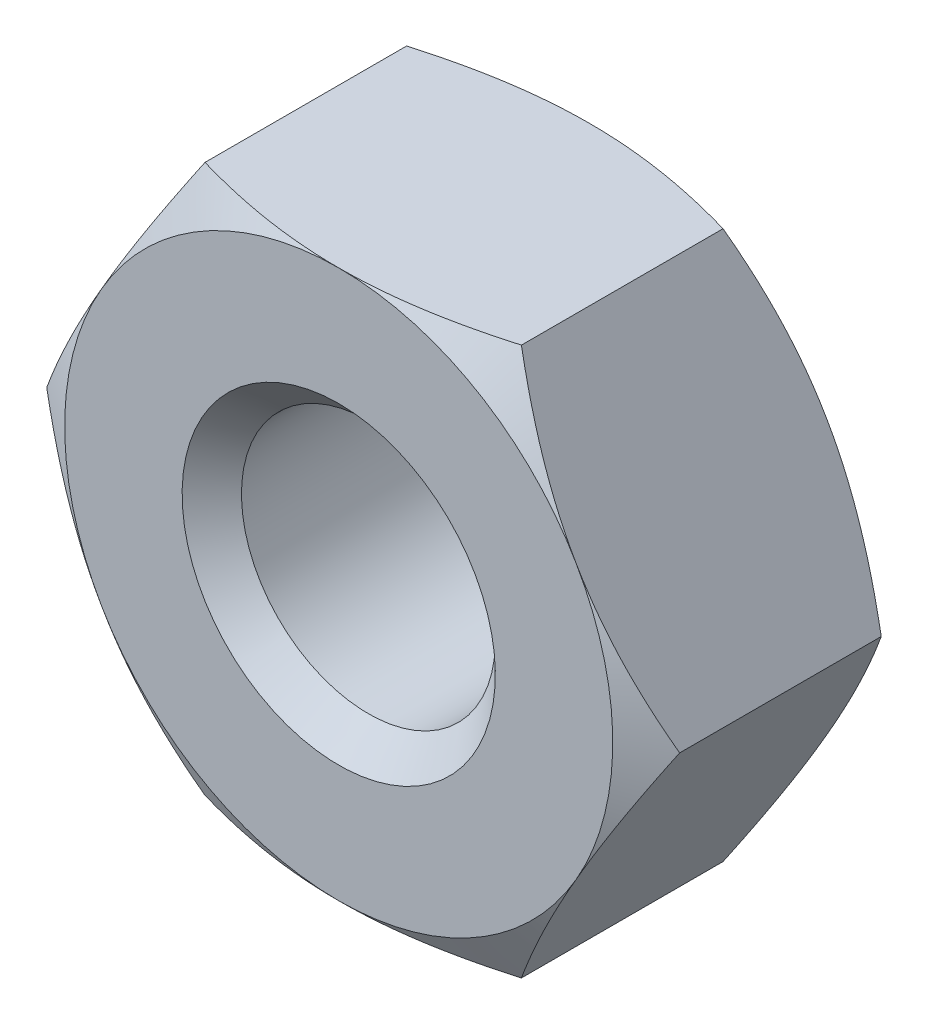
ISO-10303-21;
HEADER;
FILE_DESCRIPTION(('STEP AP214'),'2;1');
FILE_NAME('part.step','',(''),(''),'','','');
FILE_SCHEMA(('AUTOMOTIVE_DESIGN { 1 0 10303 214 1 1 1 1 }'));
ENDSEC;
DATA;
#1=APPLICATION_CONTEXT('core data for automotive mechanical design processes');
#2=APPLICATION_PROTOCOL_DEFINITION('international standard','automotive_design',2000,#1);
#3=PRODUCT_CONTEXT('',#1,'mechanical');
#4=PRODUCT('Part','Part','',(#3));
#5=PRODUCT_RELATED_PRODUCT_CATEGORY('part','',(#4));
#6=PRODUCT_DEFINITION_FORMATION('','',#4);
#7=PRODUCT_DEFINITION_CONTEXT('part definition',#1,'design');
#8=PRODUCT_DEFINITION('design','',#6,#7);
#9=PRODUCT_DEFINITION_SHAPE('','',#8);
#10=(LENGTH_UNIT() NAMED_UNIT(*) SI_UNIT(.MILLI.,.METRE.));
#11=(NAMED_UNIT(*) PLANE_ANGLE_UNIT() SI_UNIT($,.RADIAN.));
#12=(NAMED_UNIT(*) SI_UNIT($,.STERADIAN.) SOLID_ANGLE_UNIT());
#13=UNCERTAINTY_MEASURE_WITH_UNIT(LENGTH_MEASURE(1.E-05),#10,'distance_accuracy_value','');
#14=(GEOMETRIC_REPRESENTATION_CONTEXT(3) GLOBAL_UNCERTAINTY_ASSIGNED_CONTEXT((#13)) GLOBAL_UNIT_ASSIGNED_CONTEXT((#10,
#11,#12)) REPRESENTATION_CONTEXT('',''));
#15=CARTESIAN_POINT('',(0.,0.,0.));
#16=DIRECTION('',(0.,0.,1.));
#17=DIRECTION('',(1.,0.,0.));
#18=AXIS2_PLACEMENT_3D('',#15,#16,#17);
#19=CARTESIAN_POINT('',(0.,0.,0.));
#20=DIRECTION('',(0.,0.,1.));
#21=DIRECTION('',(0.,-1.,0.));
#22=AXIS2_PLACEMENT_3D('',#19,#20,#21);
#23=CONICAL_SURFACE('',#22,3.5,1.0471975511966);
#24=CARTESIAN_POINT('',(-4.04145303902792,-1.99999999942575E-06,0.312608057836595));
#25=CARTESIAN_POINT('',(-3.9526543523417,0.153801836985914,0.261325207051108));
#26=CARTESIAN_POINT('',(-3.8630891566982,0.308933306430309,0.214686129843125));
#27=CARTESIAN_POINT('',(-3.68240800237188,0.621882245693687,0.133279002154489));
#28=CARTESIAN_POINT('',(-3.59128883436789,0.779705274219995,0.0985397473195982));
#29=CARTESIAN_POINT('',(-3.41017969311695,1.0933955085818,0.04446556637395));
#30=CARTESIAN_POINT('',(-3.32021757810618,1.2492144625368,0.0247707051024597));
#31=CARTESIAN_POINT('',(-3.13987026516455,1.56158517156023,0.00126350234264278));
#32=CARTESIAN_POINT('',(-3.049485722302,1.71813579201706,-0.00256830976409229));
#33=CARTESIAN_POINT('',(-2.88061174798552,2.01063409560929,0.00542331795289644));
#34=CARTESIAN_POINT('',(-2.8020969762473,2.14662566940455,0.0152845482259451));
#35=CARTESIAN_POINT('',(-2.64557893115677,2.41772287580271,0.0465326054195978));
#36=CARTESIAN_POINT('',(-2.5675761987588,2.55282757144519,0.0679300962771088));
#37=CARTESIAN_POINT('',(-2.41073570896219,2.82448326845691,0.121419707592684));
#38=CARTESIAN_POINT('',(-2.33191779193778,2.96099990528993,0.153738462339012));
#39=CARTESIAN_POINT('',(-2.1754571904442,3.2319976164596,0.227088382233704));
#40=CARTESIAN_POINT('',(-2.09781250306361,3.36648215994059,0.268102324014377));
#41=CARTESIAN_POINT('',(-2.02072478746315,3.500002,0.312608057836596));
#42=B_SPLINE_CURVE_WITH_KNOTS('',3,(#24,#25,#26,#27,#28,#29,#30,#31,#32,#33,#34,#35,#36,#37,#38,
#39,#40,#41),.UNSPECIFIED.,.F.,.F.,(4,2,2,2,2,2,2,2,4),(0.,0.554778178344818,1.1108895003682,
1.65323877434932,2.19492216043833,2.66649024647641,3.13849499186579,3.62096657220665,
4.10249125897129),.UNSPECIFIED.);
#43=CARTESIAN_POINT('',(-3.03108891324554,1.75,0.));
#44=VERTEX_POINT('',#43);
#45=CARTESIAN_POINT('',(-2.02072594216369,3.5,0.312607391169643));
#46=VERTEX_POINT('',#45);
#47=EDGE_CURVE('E222',#44,#46,#42,.T.);
#48=ORIENTED_EDGE('',*,*,#47,.T.);
#49=CARTESIAN_POINT('',(-5.35934692412504,3.5,1.6748840414578));
#50=CARTESIAN_POINT('',(-5.20567647840356,3.5,1.60062164540258));
#51=CARTESIAN_POINT('',(-5.05164271451145,3.5,1.52709745330194));
#52=CARTESIAN_POINT('',(-4.74265210486078,3.5,1.38194731027651));
#53=CARTESIAN_POINT('',(-4.58769510490404,3.5,1.31032168799129));
#54=CARTESIAN_POINT('',(-4.275824553831,3.5,1.16901320847468));
#55=CARTESIAN_POINT('',(-4.11890488076336,3.5,1.09934381371584));
#56=CARTESIAN_POINT('',(-3.80377582374881,3.5,0.962997372539523));
#57=CARTESIAN_POINT('',(-3.64556650753467,3.5,0.896320170151796));
#58=CARTESIAN_POINT('',(-3.32564210305103,3.5,0.765962027723632));
#59=CARTESIAN_POINT('',(-3.16390782137574,3.5,0.702327933712004));
#60=CARTESIAN_POINT('',(-2.838531618061,3.5,0.580043345264359));
#61=CARTESIAN_POINT('',(-2.6748894864838,3.5,0.521393405279084));
#62=CARTESIAN_POINT('',(-2.34577331272591,3.5,0.410652971362006));
#63=CARTESIAN_POINT('',(-2.18030401104538,3.5,0.358548532806305));
#64=CARTESIAN_POINT('',(-1.84701304087969,3.5,0.262591230795525));
#65=CARTESIAN_POINT('',(-1.67919213437666,3.5,0.218735757984312));
#66=CARTESIAN_POINT('',(-1.34108336693728,3.5,0.141405407149236));
#67=CARTESIAN_POINT('',(-1.17079486277189,3.5,0.107933288625102));
#68=CARTESIAN_POINT('',(-0.828164666046136,3.5,0.0536232411847831));
#69=CARTESIAN_POINT('',(-0.655822971685647,3.5,0.0327853233463299));
#70=CARTESIAN_POINT('',(-0.311079729709311,3.5,0.00558710240427237));
#71=CARTESIAN_POINT('',(-0.138685602003801,3.5,-0.000864864155453443));
#72=CARTESIAN_POINT('',(0.205982076333879,3.5,0.00105162467073649));
#73=CARTESIAN_POINT('',(0.378255646651036,3.5,0.00941623254121618));
#74=CARTESIAN_POINT('',(0.672435089180329,3.5,0.0357628772519745));
#75=CARTESIAN_POINT('',(0.794665505380771,3.5,0.0503133304052149));
#76=CARTESIAN_POINT('',(1.03818220100523,3.5,0.085926760416871));
#77=CARTESIAN_POINT('',(1.15946832844467,3.5,0.106990764298889));
#78=CARTESIAN_POINT('',(1.52181137729793,3.5,0.178847624115623));
#79=CARTESIAN_POINT('',(1.76116994121843,3.5,0.23828682891582));
#80=CARTESIAN_POINT('',(2.11933379257993,3.5,0.340804107281189));
#81=CARTESIAN_POINT('',(2.24000598915561,3.5,0.377725589264581));
#82=CARTESIAN_POINT('',(2.48009089087908,3.5,0.455222131908248));
#83=CARTESIAN_POINT('',(2.59950440212693,3.5,0.495794672641366));
#84=CARTESIAN_POINT('',(2.83657258518354,3.5,0.579749074905746));
#85=CARTESIAN_POINT('',(2.95423337362994,3.5,0.623113838589409));
#86=CARTESIAN_POINT('',(3.18864204487703,3.5,0.712388757549099));
#87=CARTESIAN_POINT('',(3.30538953667539,3.5,0.758299941515014));
#88=CARTESIAN_POINT('',(3.42171488807854,3.5,0.805233055846148));
#89=B_SPLINE_CURVE_WITH_KNOTS('',3,(#49,#50,#51,#52,#53,#54,#55,#56,#57,#58,#59,#60,#61,#62,#63,
#64,#65,#66,#67,#68,#69,#70,#71,#72,#73,#74,#75,#76,#77,#78,#79,#80,#81,#82,#83,#84,#85,#86,#87,
#88),.UNSPECIFIED.,.F.,.F.,(4,2,2,2,2,2,2,2,2,2,2,2,2,2,2,2,2,2,2,4),(0.,0.512027950737723,
1.02414396148803,1.53919045875332,2.05421007757958,2.57555381631374,3.09695547502097,
3.61722678349793,4.13733323922925,4.65757780124304,5.1778228194093,5.69474338573791,
6.21152973964697,6.58062976625125,6.94978802037408,7.68865391675854,8.06720645375622,
8.4454996923548,8.82166367886255,9.19798074895271),.UNSPECIFIED.);
#90=CARTESIAN_POINT('',(0.,3.5,0.));
#91=VERTEX_POINT('',#90);
#92=EDGE_CURVE('E119',#46,#91,#89,.T.);
#93=ORIENTED_EDGE('',*,*,#92,.T.);
#94=CARTESIAN_POINT('',(0.,0.,0.));
#95=DIRECTION('',(0.,0.,-1.));
#96=DIRECTION('',(0.,1.,0.));
#97=AXIS2_PLACEMENT_3D('',#94,#95,#96);
#98=CIRCLE('',#97,3.5);
#99=EDGE_CURVE('E254',#44,#91,#98,.T.);
#100=ORIENTED_EDGE('',*,*,#99,.F.);
#101=EDGE_LOOP('',(#48,#93,#100));
#102=FACE_BOUND('',#101,.T.);
#103=ADVANCED_FACE('F16',(#102),#23,.T.);
#104=CARTESIAN_POINT('',(3.03108891324554,1.75,0.));
#105=VERTEX_POINT('',#104);
#106=EDGE_CURVE('E246',#91,#105,#98,.T.);
#107=ORIENTED_EDGE('',*,*,#106,.F.);
#108=CARTESIAN_POINT('',(2.02072594216369,3.5,0.312607391169643));
#109=VERTEX_POINT('',#108);
#110=EDGE_CURVE('E216',#91,#109,#89,.T.);
#111=ORIENTED_EDGE('',*,*,#110,.T.);
#112=CARTESIAN_POINT('',(2.02072478746316,3.500002,0.312608057836596));
#113=CARTESIAN_POINT('',(2.10952347414937,3.34619816301409,0.261325207051108));
#114=CARTESIAN_POINT('',(2.19908866979287,3.19106669356969,0.214686129843125));
#115=CARTESIAN_POINT('',(2.37976982411919,2.87811775430631,0.133279002154489));
#116=CARTESIAN_POINT('',(2.47088899212318,2.72029472578,0.0985397473195982));
#117=CARTESIAN_POINT('',(2.65199813337412,2.4066044914182,0.0444655663739501));
#118=CARTESIAN_POINT('',(2.74196024838489,2.2507855374632,0.0247707051024598));
#119=CARTESIAN_POINT('',(2.92230756132652,1.93841482843977,0.0012635023426431));
#120=CARTESIAN_POINT('',(3.01269210418907,1.78186420798294,-0.00256830976409182));
#121=CARTESIAN_POINT('',(3.18156607850555,1.48936590439071,0.0054233179528968));
#122=CARTESIAN_POINT('',(3.26008085024377,1.35337433059545,0.0152845482259452));
#123=CARTESIAN_POINT('',(3.4165988953343,1.08227712419729,0.0465326054195978));
#124=CARTESIAN_POINT('',(3.49460162773227,0.94717242855481,0.0679300962771087));
#125=CARTESIAN_POINT('',(3.65144211752888,0.675516731543088,0.121419707592684));
#126=CARTESIAN_POINT('',(3.73026003455329,0.539000094710069,0.153738462339012));
#127=CARTESIAN_POINT('',(3.88672063604687,0.268002383540401,0.227088382233704));
#128=CARTESIAN_POINT('',(3.96436532342746,0.133517840059407,0.268102324014377));
#129=CARTESIAN_POINT('',(4.04145303902792,-2.00000000017778E-06,0.312608057836595));
#130=B_SPLINE_CURVE_WITH_KNOTS('',3,(#112,#113,#114,#115,#116,#117,#118,#119,#120,#121,#122,
#123,#124,#125,#126,#127,#128,#129),.UNSPECIFIED.,.F.,.F.,(4,2,2,2,2,2,2,2,4),(0.,
0.554778178344817,1.1108895003682,1.65323877434931,2.19492216043833,2.66649024647641,
3.13849499186579,3.62096657220665,4.10249125897128),.UNSPECIFIED.);
#131=EDGE_CURVE('E210',#109,#105,#130,.T.);
#132=ORIENTED_EDGE('',*,*,#131,.T.);
#133=EDGE_LOOP('',(#107,#111,#132));
#134=FACE_BOUND('',#133,.T.);
#135=ADVANCED_FACE('F243',(#134),#23,.T.);
#136=CARTESIAN_POINT('',(3.03108891324554,-1.75,0.));
#137=VERTEX_POINT('',#136);
#138=EDGE_CURVE('E252',#105,#137,#98,.T.);
#139=ORIENTED_EDGE('',*,*,#138,.F.);
#140=CARTESIAN_POINT('',(4.04145188432738,0.,0.312607391169643));
#141=VERTEX_POINT('',#140);
#142=EDGE_CURVE('E202',#105,#141,#130,.T.);
#143=ORIENTED_EDGE('',*,*,#142,.T.);
#144=CARTESIAN_POINT('',(4.04145303902792,1.99999999977168E-06,0.312608057836595));
#145=CARTESIAN_POINT('',(3.95265435234171,-0.153801836985914,0.261325207051109));
#146=CARTESIAN_POINT('',(3.8630891566982,-0.30893330643031,0.214686129843126));
#147=CARTESIAN_POINT('',(3.68240800237188,-0.621882245693688,0.13327900215449));
#148=CARTESIAN_POINT('',(3.5912888343679,-0.779705274219996,0.0985397473195994));
#149=CARTESIAN_POINT('',(3.41017969311695,-1.0933955085818,0.0444655663739513));
#150=CARTESIAN_POINT('',(3.32021757810618,-1.2492144625368,0.024770705102461));
#151=CARTESIAN_POINT('',(3.13987026516455,-1.56158517156023,0.00126350234264337));
#152=CARTESIAN_POINT('',(3.049485722302,-1.71813579201706,-0.00256830976409247));
#153=CARTESIAN_POINT('',(2.88061174798552,-2.01063409560929,0.00542331795289657));
#154=CARTESIAN_POINT('',(2.8020969762473,-2.14662566940455,0.015284548225946));
#155=CARTESIAN_POINT('',(2.64557893115677,-2.41772287580271,0.0465326054195992));
#156=CARTESIAN_POINT('',(2.5675761987588,-2.55282757144519,0.0679300962771096));
#157=CARTESIAN_POINT('',(2.41073570896219,-2.82448326845691,0.121419707592684));
#158=CARTESIAN_POINT('',(2.33191779193778,-2.96099990528993,0.153738462339012));
#159=CARTESIAN_POINT('',(2.1754571904442,-3.2319976164596,0.227088382233704));
#160=CARTESIAN_POINT('',(2.09781250306361,-3.36648215994059,0.268102324014377));
#161=CARTESIAN_POINT('',(2.02072478746315,-3.500002,0.312608057836596));
#162=B_SPLINE_CURVE_WITH_KNOTS('',3,(#144,#145,#146,#147,#148,#149,#150,#151,#152,#153,#154,
#155,#156,#157,#158,#159,#160,#161),.UNSPECIFIED.,.F.,.F.,(4,2,2,2,2,2,2,2,4),(0.,
0.554778178344817,1.1108895003682,1.65323877434932,2.19492216043833,2.66649024647641,
3.13849499186579,3.62096657220665,4.10249125897129),.UNSPECIFIED.);
#163=EDGE_CURVE('E623',#141,#137,#162,.T.);
#164=ORIENTED_EDGE('',*,*,#163,.T.);
#165=EDGE_LOOP('',(#139,#143,#164));
#166=FACE_BOUND('',#165,.T.);
#167=ADVANCED_FACE('F324',(#166),#23,.T.);
#168=CARTESIAN_POINT('',(-2.02072478746316,-3.500002,0.312608057836596));
#169=CARTESIAN_POINT('',(-2.10952347414937,-3.34619816301409,0.261325207051108));
#170=CARTESIAN_POINT('',(-2.19908866979287,-3.19106669356969,0.214686129843125));
#171=CARTESIAN_POINT('',(-2.37976982411919,-2.87811775430631,0.133279002154489));
#172=CARTESIAN_POINT('',(-2.47088899212318,-2.72029472578,0.0985397473195984));
#173=CARTESIAN_POINT('',(-2.65199813337412,-2.4066044914182,0.0444655663739503));
#174=CARTESIAN_POINT('',(-2.74196024838489,-2.25078553746319,0.0247707051024599));
#175=CARTESIAN_POINT('',(-2.92230756132652,-1.93841482843977,0.00126350234264309));
#176=CARTESIAN_POINT('',(-3.01269210418907,-1.78186420798294,-0.00256830976409179));
#177=CARTESIAN_POINT('',(-3.18156607850555,-1.48936590439071,0.00542331795289685));
#178=CARTESIAN_POINT('',(-3.26008085024377,-1.35337433059545,0.0152845482259453));
#179=CARTESIAN_POINT('',(-3.4165988953343,-1.08227712419729,0.0465326054195978));
#180=CARTESIAN_POINT('',(-3.49460162773227,-0.947172428554809,0.0679300962771088));
#181=CARTESIAN_POINT('',(-3.65144211752888,-0.675516731543088,0.121419707592684));
#182=CARTESIAN_POINT('',(-3.73026003455329,-0.539000094710069,0.153738462339012));
#183=CARTESIAN_POINT('',(-3.88672063604687,-0.2680023835404,0.227088382233704));
#184=CARTESIAN_POINT('',(-3.96436532342746,-0.133517840059406,0.268102324014377));
#185=CARTESIAN_POINT('',(-4.04145303902792,2.00000000086035E-06,0.312608057836595));
#186=B_SPLINE_CURVE_WITH_KNOTS('',3,(#168,#169,#170,#171,#172,#173,#174,#175,#176,#177,#178,
#179,#180,#181,#182,#183,#184,#185),.UNSPECIFIED.,.F.,.F.,(4,2,2,2,2,2,2,2,4),(0.,
0.554778178344817,1.1108895003682,1.65323877434931,2.19492216043833,2.66649024647641,
3.13849499186579,3.62096657220665,4.10249125897128),.UNSPECIFIED.);
#187=CARTESIAN_POINT('',(-3.03108891324554,-1.75,0.));
#188=VERTEX_POINT('',#187);
#189=CARTESIAN_POINT('',(-4.04145188432738,0.,0.312607391169643));
#190=VERTEX_POINT('',#189);
#191=EDGE_CURVE('E626',#188,#190,#186,.T.);
#192=ORIENTED_EDGE('',*,*,#191,.T.);
#193=EDGE_CURVE('E211',#190,#44,#42,.T.);
#194=ORIENTED_EDGE('',*,*,#193,.T.);
#195=EDGE_CURVE('E262',#188,#44,#98,.T.);
#196=ORIENTED_EDGE('',*,*,#195,.F.);
#197=EDGE_LOOP('',(#192,#194,#196));
#198=FACE_BOUND('',#197,.T.);
#199=ADVANCED_FACE('F331',(#198),#23,.T.);
#200=CARTESIAN_POINT('',(0.,-3.5,0.));
#201=VERTEX_POINT('',#200);
#202=EDGE_CURVE('E259',#137,#201,#98,.T.);
#203=ORIENTED_EDGE('',*,*,#202,.F.);
#204=CARTESIAN_POINT('',(2.02072594216369,-3.5,0.312607391169643));
#205=VERTEX_POINT('',#204);
#206=EDGE_CURVE('E38',#137,#205,#162,.T.);
#207=ORIENTED_EDGE('',*,*,#206,.T.);
#208=CARTESIAN_POINT('',(-5.35934692412504,-3.5,1.6748840414578));
#209=CARTESIAN_POINT('',(-5.20567647840356,-3.5,1.60062164540258));
#210=CARTESIAN_POINT('',(-5.05164271451145,-3.5,1.52709745330194));
#211=CARTESIAN_POINT('',(-4.74265210486078,-3.5,1.38194731027651));
#212=CARTESIAN_POINT('',(-4.58769510490404,-3.5,1.31032168799129));
#213=CARTESIAN_POINT('',(-4.275824553831,-3.5,1.16901320847468));
#214=CARTESIAN_POINT('',(-4.11890488076336,-3.5,1.09934381371584));
#215=CARTESIAN_POINT('',(-3.80377582374881,-3.5,0.962997372539522));
#216=CARTESIAN_POINT('',(-3.64556650753466,-3.5,0.896320170151795));
#217=CARTESIAN_POINT('',(-3.32564210305102,-3.5,0.765962027723632));
#218=CARTESIAN_POINT('',(-3.16390782137574,-3.5,0.702327933712004));
#219=CARTESIAN_POINT('',(-2.838531618061,-3.5,0.580043345264358));
#220=CARTESIAN_POINT('',(-2.67488948648379,-3.5,0.521393405279083));
#221=CARTESIAN_POINT('',(-2.34577331272591,-3.5,0.410652971362005));
#222=CARTESIAN_POINT('',(-2.18030401104538,-3.5,0.358548532806305));
#223=CARTESIAN_POINT('',(-1.84701304087969,-3.5,0.262591230795526));
#224=CARTESIAN_POINT('',(-1.67919213437666,-3.5,0.218735757984312));
#225=CARTESIAN_POINT('',(-1.34108336693728,-3.5,0.141405407149236));
#226=CARTESIAN_POINT('',(-1.1707948627719,-3.5,0.107933288625103));
#227=CARTESIAN_POINT('',(-0.828164666046137,-3.5,0.0536232411847841));
#228=CARTESIAN_POINT('',(-0.655822971685649,-3.5,0.032785323346331));
#229=CARTESIAN_POINT('',(-0.311079729709314,-3.5,0.00558710240427367));
#230=CARTESIAN_POINT('',(-0.138685602003805,-3.5,-0.000864864155452));
#231=CARTESIAN_POINT('',(0.205982076333874,-3.5,0.0010516246707375));
#232=CARTESIAN_POINT('',(0.378255646651032,-3.5,0.00941623254121668));
#233=CARTESIAN_POINT('',(0.672435089180325,-3.5,0.0357628772519751));
#234=CARTESIAN_POINT('',(0.794665505380768,-3.5,0.0503133304052159));
#235=CARTESIAN_POINT('',(1.03818220100523,-3.5,0.0859267604168723));
#236=CARTESIAN_POINT('',(1.15946832844466,-3.5,0.10699076429889));
#237=CARTESIAN_POINT('',(1.52181137729793,-3.5,0.178847624115624));
#238=CARTESIAN_POINT('',(1.76116994121843,-3.5,0.238286828915822));
#239=CARTESIAN_POINT('',(2.11933379257993,-3.5,0.340804107281191));
#240=CARTESIAN_POINT('',(2.24000598915561,-3.5,0.377725589264582));
#241=CARTESIAN_POINT('',(2.48009089087908,-3.5,0.45522213190825));
#242=CARTESIAN_POINT('',(2.59950440212693,-3.5,0.495794672641368));
#243=CARTESIAN_POINT('',(2.83657258518354,-3.5,0.579749074905749));
#244=CARTESIAN_POINT('',(2.95423337362994,-3.5,0.623113838589411));
#245=CARTESIAN_POINT('',(3.18864204487703,-3.5,0.712388757549101));
#246=CARTESIAN_POINT('',(3.30538953667539,-3.5,0.758299941515016));
#247=CARTESIAN_POINT('',(3.42171488807854,-3.5,0.80523305584615));
#248=B_SPLINE_CURVE_WITH_KNOTS('',3,(#208,#209,#210,#211,#212,#213,#214,#215,#216,#217,#218,
#219,#220,#221,#222,#223,#224,#225,#226,#227,#228,#229,#230,#231,#232,#233,#234,#235,#236,#237,
#238,#239,#240,#241,#242,#243,#244,#245,#246,#247),.UNSPECIFIED.,.F.,.F.,(4,2,2,2,2,2,2,2,2,2,2,
2,2,2,2,2,2,2,2,4),(0.,0.512027950737723,1.02414396148803,1.53919045875332,2.05421007757958,
2.57555381631375,3.09695547502097,3.61722678349793,4.13733323922925,4.65757780124304,
5.1778228194093,5.6947433857379,6.21152973964697,6.58062976625124,6.94978802037408,
7.68865391675854,8.06720645375622,8.4454996923548,8.82166367886255,9.19798074895271),.UNSPECIFIED.);
#249=EDGE_CURVE('E11',#205,#201,#248,.F.);
#250=ORIENTED_EDGE('',*,*,#249,.T.);
#251=EDGE_LOOP('',(#203,#207,#250));
#252=FACE_BOUND('',#251,.T.);
#253=ADVANCED_FACE('F327',(#252),#23,.T.);
#254=CARTESIAN_POINT('',(-2.02072594216369,-3.5,0.312607391169643));
#255=VERTEX_POINT('',#254);
#256=EDGE_CURVE('E21',#201,#255,#248,.F.);
#257=ORIENTED_EDGE('',*,*,#256,.T.);
#258=EDGE_CURVE('E126',#255,#188,#186,.T.);
#259=ORIENTED_EDGE('',*,*,#258,.T.);
#260=EDGE_CURVE('E269',#201,#188,#98,.T.);
#261=ORIENTED_EDGE('',*,*,#260,.F.);
#262=EDGE_LOOP('',(#257,#259,#261));
#263=FACE_BOUND('',#262,.T.);
#264=ADVANCED_FACE('F152',(#263),#23,.T.);
#265=CARTESIAN_POINT('',(0.,0.,2.88678747896463));
#266=DIRECTION('',(0.,0.,-1.));
#267=DIRECTION('',(0.,1.,0.));
#268=AXIS2_PLACEMENT_3D('',#265,#266,#267);
#269=CONICAL_SURFACE('',#268,4.0425,1.0471975511966);
#270=CARTESIAN_POINT('',(-5.35934692412504,-3.5,1.5251159585422));
#271=CARTESIAN_POINT('',(-5.20567647840356,-3.5,1.59937835459742));
#272=CARTESIAN_POINT('',(-5.05164271451144,-3.5,1.67290254669806));
#273=CARTESIAN_POINT('',(-4.74265210486078,-3.5,1.8180526897235));
#274=CARTESIAN_POINT('',(-4.58769510490403,-3.5,1.88967831200871));
#275=CARTESIAN_POINT('',(-4.275824553831,-3.5,2.03098679152532));
#276=CARTESIAN_POINT('',(-4.11890488076336,-3.5,2.10065618628416));
#277=CARTESIAN_POINT('',(-3.8037758237488,-3.5,2.23700262746048));
#278=CARTESIAN_POINT('',(-3.64556650753466,-3.5,2.30367982984821));
#279=CARTESIAN_POINT('',(-3.32564210305102,-3.5,2.43403797227637));
#280=CARTESIAN_POINT('',(-3.16390782137574,-3.5,2.497672066288));
#281=CARTESIAN_POINT('',(-2.838531618061,-3.5,2.61995665473564));
#282=CARTESIAN_POINT('',(-2.67488948648379,-3.5,2.67860659472092));
#283=CARTESIAN_POINT('',(-2.34577331272591,-3.5,2.789347028638));
#284=CARTESIAN_POINT('',(-2.18030401104538,-3.5,2.8414514671937));
#285=CARTESIAN_POINT('',(-1.84701304087969,-3.5,2.93740876920448));
#286=CARTESIAN_POINT('',(-1.67919213437666,-3.5,2.98126424201569));
#287=CARTESIAN_POINT('',(-1.34108336693728,-3.5,3.05859459285077));
#288=CARTESIAN_POINT('',(-1.17079486277189,-3.5,3.0920667113749));
#289=CARTESIAN_POINT('',(-0.828164666046137,-3.5,3.14637675881522));
#290=CARTESIAN_POINT('',(-0.655822971685649,-3.5,3.16721467665367));
#291=CARTESIAN_POINT('',(-0.311079729709314,-3.5,3.19441289759573));
#292=CARTESIAN_POINT('',(-0.138685602003804,-3.5,3.20086486415545));
#293=CARTESIAN_POINT('',(0.205982076333875,-3.5,3.19894837532926));
#294=CARTESIAN_POINT('',(0.378255646651032,-3.5,3.19058376745879));
#295=CARTESIAN_POINT('',(0.672435089180325,-3.5,3.16423712274803));
#296=CARTESIAN_POINT('',(0.794665505380768,-3.5,3.14968666959479));
#297=CARTESIAN_POINT('',(1.03818220100523,-3.5,3.11407323958313));
#298=CARTESIAN_POINT('',(1.15946832844466,-3.5,3.09300923570111));
#299=CARTESIAN_POINT('',(1.52181137729793,-3.5,3.02115237588438));
#300=CARTESIAN_POINT('',(1.76116994121843,-3.5,2.96171317108418));
#301=CARTESIAN_POINT('',(2.11933379257993,-3.5,2.85919589271881));
#302=CARTESIAN_POINT('',(2.24000598915561,-3.5,2.82227441073542));
#303=CARTESIAN_POINT('',(2.48009089087908,-3.5,2.74477786809175));
#304=CARTESIAN_POINT('',(2.59950440212692,-3.5,2.70420532735863));
#305=CARTESIAN_POINT('',(2.83657258518354,-3.5,2.62025092509426));
#306=CARTESIAN_POINT('',(2.95423337362993,-3.5,2.57688616141059));
#307=CARTESIAN_POINT('',(3.18864204487703,-3.5,2.4876112424509));
#308=CARTESIAN_POINT('',(3.30538953667538,-3.5,2.44170005848499));
#309=CARTESIAN_POINT('',(3.42171488807853,-3.5,2.39476694415385));
#310=B_SPLINE_CURVE_WITH_KNOTS('',3,(#270,#271,#272,#273,#274,#275,#276,#277,#278,#279,#280,
#281,#282,#283,#284,#285,#286,#287,#288,#289,#290,#291,#292,#293,#294,#295,#296,#297,#298,#299,
#300,#301,#302,#303,#304,#305,#306,#307,#308,#309),.UNSPECIFIED.,.F.,.F.,(4,2,2,2,2,2,2,2,2,2,2,
2,2,2,2,2,2,2,2,4),(0.,0.512027950737725,1.02414396148804,1.53919045875332,2.05421007757959,
2.57555381631375,3.09695547502098,3.61722678349793,4.13733323922926,4.65757780124304,
5.1778228194093,5.6947433857379,6.21152973964697,6.58062976625124,6.94978802037408,
7.68865391675854,8.06720645375622,8.44549969235479,8.82166367886254,9.19798074895271),.UNSPECIFIED.);
#311=CARTESIAN_POINT('',(0.,-3.5,3.2));
#312=VERTEX_POINT('',#311);
#313=CARTESIAN_POINT('',(2.02072594216369,-3.5,2.88739260883036));
#314=VERTEX_POINT('',#313);
#315=EDGE_CURVE('E115',#312,#314,#310,.T.);
#316=ORIENTED_EDGE('',*,*,#315,.T.);
#317=CARTESIAN_POINT('',(2.02072478746315,-3.500002,2.88739194216341));
#318=CARTESIAN_POINT('',(2.10952347414936,-3.34619816301409,2.93867479294889));
#319=CARTESIAN_POINT('',(2.19908866979287,-3.19106669356969,2.98531387015688));
#320=CARTESIAN_POINT('',(2.37976982411919,-2.87811775430631,3.06672099784551));
#321=CARTESIAN_POINT('',(2.47088899212317,-2.72029472578001,3.1014602526804));
#322=CARTESIAN_POINT('',(2.65199813337412,-2.40660449141821,3.15553443362605));
#323=CARTESIAN_POINT('',(2.74196024838489,-2.2507855374632,3.17522929489754));
#324=CARTESIAN_POINT('',(2.92230756132652,-1.93841482843977,3.19873649765736));
#325=CARTESIAN_POINT('',(3.01269210418907,-1.78186420798294,3.20256830976409));
#326=CARTESIAN_POINT('',(3.18156607850555,-1.48936590439071,3.19457668204711));
#327=CARTESIAN_POINT('',(3.26008085024377,-1.35337433059545,3.18471545177406));
#328=CARTESIAN_POINT('',(3.4165988953343,-1.08227712419729,3.1534673945804));
#329=CARTESIAN_POINT('',(3.49460162773227,-0.947172428554813,3.13206990372289));
#330=CARTESIAN_POINT('',(3.65144211752888,-0.675516731543091,3.07858029240732));
#331=CARTESIAN_POINT('',(3.73026003455329,-0.539000094710072,3.04626153766099));
#332=CARTESIAN_POINT('',(3.88672063604687,-0.268002383540402,2.9729116177663));
#333=CARTESIAN_POINT('',(3.96436532342746,-0.133517840059408,2.93189767598562));
#334=CARTESIAN_POINT('',(4.04145303902792,1.99999999940561E-06,2.88739194216341));
#335=B_SPLINE_CURVE_WITH_KNOTS('',3,(#317,#318,#319,#320,#321,#322,#323,#324,#325,#326,#327,
#328,#329,#330,#331,#332,#333,#334),.UNSPECIFIED.,.F.,.F.,(4,2,2,2,2,2,2,2,4),(0.,
0.554778178344817,1.1108895003682,1.65323877434931,2.19492216043832,2.66649024647641,
3.13849499186579,3.62096657220665,4.10249125897129),.UNSPECIFIED.);
#336=CARTESIAN_POINT('',(3.03108891324554,-1.75,3.2));
#337=VERTEX_POINT('',#336);
#338=EDGE_CURVE('E121',#314,#337,#335,.T.);
#339=ORIENTED_EDGE('',*,*,#338,.T.);
#340=CARTESIAN_POINT('',(0.,0.,3.2));
#341=DIRECTION('',(0.,0.,-1.));
#342=DIRECTION('',(0.,1.,0.));
#343=AXIS2_PLACEMENT_3D('',#340,#341,#342);
#344=CIRCLE('',#343,3.5);
#345=EDGE_CURVE('E129',#337,#312,#344,.T.);
#346=ORIENTED_EDGE('',*,*,#345,.T.);
#347=EDGE_LOOP('',(#316,#339,#346));
#348=FACE_BOUND('',#347,.T.);
#349=ADVANCED_FACE('F128',(#348),#269,.T.);
#350=CARTESIAN_POINT('',(3.03108891324554,1.75,3.2));
#351=VERTEX_POINT('',#350);
#352=EDGE_CURVE('E271',#351,#337,#344,.T.);
#353=ORIENTED_EDGE('',*,*,#352,.T.);
#354=CARTESIAN_POINT('',(4.04145188432738,0.,2.88739260883036));
#355=VERTEX_POINT('',#354);
#356=EDGE_CURVE('E45',#337,#355,#335,.T.);
#357=ORIENTED_EDGE('',*,*,#356,.T.);
#358=CARTESIAN_POINT('',(4.04145303902792,-2.00000000014165E-06,2.88739194216341));
#359=CARTESIAN_POINT('',(3.9526543523417,0.153801836985913,2.93867479294889));
#360=CARTESIAN_POINT('',(3.8630891566982,0.308933306430308,2.98531387015688));
#361=CARTESIAN_POINT('',(3.68240800237188,0.621882245693686,3.06672099784551));
#362=CARTESIAN_POINT('',(3.59128883436789,0.779705274219994,3.1014602526804));
#363=CARTESIAN_POINT('',(3.41017969311695,1.0933955085818,3.15553443362605));
#364=CARTESIAN_POINT('',(3.32021757810618,1.2492144625368,3.17522929489754));
#365=CARTESIAN_POINT('',(3.13987026516455,1.56158517156023,3.19873649765736));
#366=CARTESIAN_POINT('',(3.049485722302,1.71813579201706,3.20256830976409));
#367=CARTESIAN_POINT('',(2.88061174798552,2.01063409560929,3.19457668204711));
#368=CARTESIAN_POINT('',(2.8020969762473,2.14662566940455,3.18471545177406));
#369=CARTESIAN_POINT('',(2.64557893115677,2.41772287580271,3.1534673945804));
#370=CARTESIAN_POINT('',(2.5675761987588,2.55282757144519,3.13206990372289));
#371=CARTESIAN_POINT('',(2.41073570896219,2.82448326845691,3.07858029240732));
#372=CARTESIAN_POINT('',(2.33191779193778,2.96099990528993,3.04626153766099));
#373=CARTESIAN_POINT('',(2.1754571904442,3.2319976164596,2.9729116177663));
#374=CARTESIAN_POINT('',(2.09781250306361,3.36648215994059,2.93189767598562));
#375=CARTESIAN_POINT('',(2.02072478746316,3.500002,2.88739194216341));
#376=B_SPLINE_CURVE_WITH_KNOTS('',3,(#358,#359,#360,#361,#362,#363,#364,#365,#366,#367,#368,
#369,#370,#371,#372,#373,#374,#375),.UNSPECIFIED.,.F.,.F.,(4,2,2,2,2,2,2,2,4),(0.,
0.554778178344818,1.1108895003682,1.65323877434932,2.19492216043833,2.66649024647641,
3.13849499186579,3.62096657220665,4.10249125897128),.UNSPECIFIED.);
#377=EDGE_CURVE('E188',#355,#351,#376,.T.);
#378=ORIENTED_EDGE('',*,*,#377,.T.);
#379=EDGE_LOOP('',(#353,#357,#378));
#380=FACE_BOUND('',#379,.T.);
#381=ADVANCED_FACE('F151',(#380),#269,.T.);
#382=CARTESIAN_POINT('',(0.,3.5,3.2));
#383=VERTEX_POINT('',#382);
#384=EDGE_CURVE('E263',#383,#351,#344,.T.);
#385=ORIENTED_EDGE('',*,*,#384,.T.);
#386=CARTESIAN_POINT('',(2.02072594216369,3.5,2.88739260883036));
#387=VERTEX_POINT('',#386);
#388=EDGE_CURVE('E182',#351,#387,#376,.T.);
#389=ORIENTED_EDGE('',*,*,#388,.T.);
#390=CARTESIAN_POINT('',(-5.35934692412504,3.5,1.5251159585422));
#391=CARTESIAN_POINT('',(-5.20567647840356,3.5,1.59937835459742));
#392=CARTESIAN_POINT('',(-5.05164271451144,3.5,1.67290254669806));
#393=CARTESIAN_POINT('',(-4.74265210486078,3.5,1.8180526897235));
#394=CARTESIAN_POINT('',(-4.58769510490403,3.5,1.88967831200871));
#395=CARTESIAN_POINT('',(-4.275824553831,3.5,2.03098679152532));
#396=CARTESIAN_POINT('',(-4.11890488076336,3.5,2.10065618628416));
#397=CARTESIAN_POINT('',(-3.8037758237488,3.5,2.23700262746048));
#398=CARTESIAN_POINT('',(-3.64556650753466,3.5,2.30367982984821));
#399=CARTESIAN_POINT('',(-3.32564210305102,3.5,2.43403797227637));
#400=CARTESIAN_POINT('',(-3.16390782137574,3.5,2.497672066288));
#401=CARTESIAN_POINT('',(-2.838531618061,3.5,2.61995665473564));
#402=CARTESIAN_POINT('',(-2.67488948648379,3.5,2.67860659472092));
#403=CARTESIAN_POINT('',(-2.34577331272591,3.5,2.789347028638));
#404=CARTESIAN_POINT('',(-2.18030401104538,3.5,2.8414514671937));
#405=CARTESIAN_POINT('',(-1.84701304087969,3.5,2.93740876920448));
#406=CARTESIAN_POINT('',(-1.67919213437666,3.5,2.98126424201569));
#407=CARTESIAN_POINT('',(-1.34108336693728,3.5,3.05859459285077));
#408=CARTESIAN_POINT('',(-1.17079486277189,3.5,3.0920667113749));
#409=CARTESIAN_POINT('',(-0.828164666046136,3.5,3.14637675881522));
#410=CARTESIAN_POINT('',(-0.655822971685647,3.5,3.16721467665367));
#411=CARTESIAN_POINT('',(-0.311079729709311,3.5,3.19441289759573));
#412=CARTESIAN_POINT('',(-0.138685602003801,3.5,3.20086486415545));
#413=CARTESIAN_POINT('',(0.205982076333878,3.5,3.19894837532926));
#414=CARTESIAN_POINT('',(0.378255646651036,3.5,3.19058376745879));
#415=CARTESIAN_POINT('',(0.672435089180329,3.5,3.16423712274803));
#416=CARTESIAN_POINT('',(0.794665505380772,3.5,3.14968666959479));
#417=CARTESIAN_POINT('',(1.03818220100523,3.5,3.11407323958313));
#418=CARTESIAN_POINT('',(1.15946832844467,3.5,3.09300923570111));
#419=CARTESIAN_POINT('',(1.52181137729793,3.5,3.02115237588438));
#420=CARTESIAN_POINT('',(1.76116994121843,3.5,2.96171317108418));
#421=CARTESIAN_POINT('',(2.11933379257994,3.5,2.85919589271881));
#422=CARTESIAN_POINT('',(2.24000598915561,3.5,2.82227441073542));
#423=CARTESIAN_POINT('',(2.48009089087908,3.5,2.74477786809175));
#424=CARTESIAN_POINT('',(2.59950440212693,3.5,2.70420532735863));
#425=CARTESIAN_POINT('',(2.83657258518354,3.5,2.62025092509425));
#426=CARTESIAN_POINT('',(2.95423337362994,3.5,2.57688616141059));
#427=CARTESIAN_POINT('',(3.18864204487703,3.5,2.4876112424509));
#428=CARTESIAN_POINT('',(3.30538953667539,3.5,2.44170005848499));
#429=CARTESIAN_POINT('',(3.42171488807854,3.5,2.39476694415385));
#430=B_SPLINE_CURVE_WITH_KNOTS('',3,(#390,#391,#392,#393,#394,#395,#396,#397,#398,#399,#400,
#401,#402,#403,#404,#405,#406,#407,#408,#409,#410,#411,#412,#413,#414,#415,#416,#417,#418,#419,
#420,#421,#422,#423,#424,#425,#426,#427,#428,#429),.UNSPECIFIED.,.F.,.F.,(4,2,2,2,2,2,2,2,2,2,2,
2,2,2,2,2,2,2,2,4),(0.,0.512027950737725,1.02414396148803,1.53919045875332,2.05421007757959,
2.57555381631375,3.09695547502097,3.61722678349793,4.13733323922926,4.65757780124304,
5.1778228194093,5.69474338573791,6.21152973964697,6.58062976625125,6.94978802037409,
7.68865391675855,8.06720645375623,8.4454996923548,8.82166367886255,9.19798074895271),.UNSPECIFIED.);
#431=EDGE_CURVE('E189',#387,#383,#430,.F.);
#432=ORIENTED_EDGE('',*,*,#431,.T.);
#433=EDGE_LOOP('',(#385,#389,#432));
#434=FACE_BOUND('',#433,.T.);
#435=ADVANCED_FACE('F520',(#434),#269,.T.);
#436=CARTESIAN_POINT('',(-3.03108891324554,1.75,3.2));
#437=VERTEX_POINT('',#436);
#438=EDGE_CURVE('E272',#437,#383,#344,.T.);
#439=ORIENTED_EDGE('',*,*,#438,.T.);
#440=CARTESIAN_POINT('',(-2.02072594216369,3.5,2.88739260883036));
#441=VERTEX_POINT('',#440);
#442=EDGE_CURVE('E176',#383,#441,#430,.F.);
#443=ORIENTED_EDGE('',*,*,#442,.T.);
#444=CARTESIAN_POINT('',(-2.02072478746315,3.500002,2.88739194216341));
#445=CARTESIAN_POINT('',(-2.10952347414936,3.34619816301409,2.93867479294889));
#446=CARTESIAN_POINT('',(-2.19908866979287,3.19106669356969,2.98531387015688));
#447=CARTESIAN_POINT('',(-2.37976982411919,2.87811775430631,3.06672099784551));
#448=CARTESIAN_POINT('',(-2.47088899212317,2.72029472578001,3.1014602526804));
#449=CARTESIAN_POINT('',(-2.65199813337412,2.4066044914182,3.15553443362605));
#450=CARTESIAN_POINT('',(-2.74196024838489,2.2507855374632,3.17522929489754));
#451=CARTESIAN_POINT('',(-2.92230756132652,1.93841482843977,3.19873649765736));
#452=CARTESIAN_POINT('',(-3.01269210418907,1.78186420798294,3.20256830976409));
#453=CARTESIAN_POINT('',(-3.18156607850555,1.48936590439071,3.1945766820471));
#454=CARTESIAN_POINT('',(-3.26008085024377,1.35337433059545,3.18471545177406));
#455=CARTESIAN_POINT('',(-3.4165988953343,1.08227712419729,3.1534673945804));
#456=CARTESIAN_POINT('',(-3.49460162773227,0.94717242855481,3.13206990372289));
#457=CARTESIAN_POINT('',(-3.65144211752888,0.675516731543089,3.07858029240732));
#458=CARTESIAN_POINT('',(-3.73026003455329,0.53900009471007,3.04626153766099));
#459=CARTESIAN_POINT('',(-3.88672063604687,0.2680023835404,2.9729116177663));
#460=CARTESIAN_POINT('',(-3.96436532342746,0.133517840059407,2.93189767598562));
#461=CARTESIAN_POINT('',(-4.04145303902792,-1.99999999958267E-06,2.88739194216341));
#462=B_SPLINE_CURVE_WITH_KNOTS('',3,(#444,#445,#446,#447,#448,#449,#450,#451,#452,#453,#454,
#455,#456,#457,#458,#459,#460,#461),.UNSPECIFIED.,.F.,.F.,(4,2,2,2,2,2,2,2,4),(0.,
0.554778178344817,1.1108895003682,1.65323877434932,2.19492216043833,2.66649024647641,
3.13849499186579,3.62096657220665,4.10249125897129),.UNSPECIFIED.);
#463=EDGE_CURVE('E668',#441,#437,#462,.T.);
#464=ORIENTED_EDGE('',*,*,#463,.T.);
#465=EDGE_LOOP('',(#439,#443,#464));
#466=FACE_BOUND('',#465,.T.);
#467=ADVANCED_FACE('F509',(#466),#269,.T.);
#468=CARTESIAN_POINT('',(-3.03108891324554,-1.75,3.2));
#469=VERTEX_POINT('',#468);
#470=EDGE_CURVE('E281',#469,#437,#344,.T.);
#471=ORIENTED_EDGE('',*,*,#470,.T.);
#472=CARTESIAN_POINT('',(-4.04145188432738,0.,2.88739260883036));
#473=VERTEX_POINT('',#472);
#474=EDGE_CURVE('E170',#437,#473,#462,.T.);
#475=ORIENTED_EDGE('',*,*,#474,.T.);
#476=CARTESIAN_POINT('',(-4.04145303902792,2.00000000086052E-06,2.88739194216341));
#477=CARTESIAN_POINT('',(-3.9526543523417,-0.153801836985912,2.93867479294889));
#478=CARTESIAN_POINT('',(-3.8630891566982,-0.308933306430307,2.98531387015688));
#479=CARTESIAN_POINT('',(-3.68240800237188,-0.621882245693685,3.06672099784551));
#480=CARTESIAN_POINT('',(-3.59128883436789,-0.779705274219994,3.1014602526804));
#481=CARTESIAN_POINT('',(-3.41017969311695,-1.09339550858179,3.15553443362605));
#482=CARTESIAN_POINT('',(-3.32021757810618,-1.2492144625368,3.17522929489754));
#483=CARTESIAN_POINT('',(-3.13987026516455,-1.56158517156023,3.19873649765736));
#484=CARTESIAN_POINT('',(-3.049485722302,-1.71813579201706,3.20256830976409));
#485=CARTESIAN_POINT('',(-2.88061174798552,-2.01063409560929,3.19457668204711));
#486=CARTESIAN_POINT('',(-2.8020969762473,-2.14662566940455,3.18471545177406));
#487=CARTESIAN_POINT('',(-2.64557893115677,-2.41772287580271,3.1534673945804));
#488=CARTESIAN_POINT('',(-2.5675761987588,-2.55282757144519,3.13206990372289));
#489=CARTESIAN_POINT('',(-2.41073570896219,-2.82448326845691,3.07858029240732));
#490=CARTESIAN_POINT('',(-2.33191779193778,-2.96099990528993,3.04626153766099));
#491=CARTESIAN_POINT('',(-2.1754571904442,-3.2319976164596,2.9729116177663));
#492=CARTESIAN_POINT('',(-2.09781250306361,-3.36648215994059,2.93189767598563));
#493=CARTESIAN_POINT('',(-2.02072478746316,-3.500002,2.88739194216341));
#494=B_SPLINE_CURVE_WITH_KNOTS('',3,(#476,#477,#478,#479,#480,#481,#482,#483,#484,#485,#486,
#487,#488,#489,#490,#491,#492,#493),.UNSPECIFIED.,.F.,.F.,(4,2,2,2,2,2,2,2,4),(0.,
0.554778178344818,1.1108895003682,1.65323877434932,2.19492216043833,2.66649024647641,
3.13849499186579,3.62096657220665,4.10249125897128),.UNSPECIFIED.);
#495=EDGE_CURVE('E676',#473,#469,#494,.T.);
#496=ORIENTED_EDGE('',*,*,#495,.T.);
#497=EDGE_LOOP('',(#471,#475,#496));
#498=FACE_BOUND('',#497,.T.);
#499=ADVANCED_FACE('F318',(#498),#269,.T.);
#500=EDGE_CURVE('E291',#312,#469,#344,.T.);
#501=ORIENTED_EDGE('',*,*,#500,.T.);
#502=CARTESIAN_POINT('',(-2.02072594216369,-3.5,2.88739260883036));
#503=VERTEX_POINT('',#502);
#504=EDGE_CURVE('E163',#469,#503,#494,.T.);
#505=ORIENTED_EDGE('',*,*,#504,.T.);
#506=EDGE_CURVE('E131',#503,#312,#310,.T.);
#507=ORIENTED_EDGE('',*,*,#506,.T.);
#508=EDGE_LOOP('',(#501,#505,#507));
#509=FACE_BOUND('',#508,.T.);
#510=ADVANCED_FACE('F153',(#509),#269,.T.);
#511=CARTESIAN_POINT('',(0.,0.,0.378875));
#512=DIRECTION('',(0.,0.,-1.));
#513=DIRECTION('',(0.,1.,0.));
#514=AXIS2_PLACEMENT_3D('',#511,#512,#513);
#515=CONICAL_SURFACE('',#514,1.621125,0.785398163397448);
#516=CARTESIAN_POINT('',(0.,0.,0.));
#517=DIRECTION('',(0.,0.,-1.));
#518=DIRECTION('',(0.,1.,0.));
#519=AXIS2_PLACEMENT_3D('',#516,#517,#518);
#520=CIRCLE('',#519,2.);
#521=CARTESIAN_POINT('',(0.,2.,0.));
#522=VERTEX_POINT('',#521);
#523=EDGE_CURVE('E251',#522,#522,#520,.T.);
#524=ORIENTED_EDGE('',*,*,#523,.T.);
#525=EDGE_LOOP('',(#524));
#526=FACE_BOUND('',#525,.T.);
#527=CARTESIAN_POINT('',(0.,0.,0.378875));
#528=DIRECTION('',(0.,0.,-1.));
#529=DIRECTION('',(0.,1.,0.));
#530=AXIS2_PLACEMENT_3D('',#527,#528,#529);
#531=CIRCLE('',#530,1.621125);
#532=CARTESIAN_POINT('',(0.,1.621125,0.378875));
#533=VERTEX_POINT('',#532);
#534=EDGE_CURVE('E299',#533,#533,#531,.T.);
#535=ORIENTED_EDGE('',*,*,#534,.F.);
#536=EDGE_LOOP('',(#535));
#537=FACE_BOUND('',#536,.T.);
#538=ADVANCED_FACE('F310',(#526,#537),#515,.F.);
#539=CARTESIAN_POINT('',(2.,0.,0.));
#540=DIRECTION('',(0.,0.,-1.));
#541=DIRECTION('',(0.,1.,0.));
#542=AXIS2_PLACEMENT_3D('',#539,#540,#541);
#543=PLANE('',#542);
#544=ORIENTED_EDGE('',*,*,#106,.T.);
#545=ORIENTED_EDGE('',*,*,#138,.T.);
#546=ORIENTED_EDGE('',*,*,#202,.T.);
#547=ORIENTED_EDGE('',*,*,#260,.T.);
#548=ORIENTED_EDGE('',*,*,#195,.T.);
#549=ORIENTED_EDGE('',*,*,#99,.T.);
#550=EDGE_LOOP('',(#544,#545,#546,#547,#548,#549));
#551=FACE_BOUND('',#550,.T.);
#552=ORIENTED_EDGE('',*,*,#523,.F.);
#553=EDGE_LOOP('',(#552));
#554=FACE_BOUND('',#553,.T.);
#555=ADVANCED_FACE('F312',(#551,#554),#543,.T.);
#556=CARTESIAN_POINT('',(3.5,0.,3.2));
#557=DIRECTION('',(0.,0.,1.));
#558=DIRECTION('',(0.,-1.,0.));
#559=AXIS2_PLACEMENT_3D('',#556,#557,#558);
#560=PLANE('',#559);
#561=CARTESIAN_POINT('',(0.,0.,3.2));
#562=DIRECTION('',(0.,0.,-1.));
#563=DIRECTION('',(0.,1.,0.));
#564=AXIS2_PLACEMENT_3D('',#561,#562,#563);
#565=CIRCLE('',#564,2.);
#566=CARTESIAN_POINT('',(0.,2.,3.2));
#567=VERTEX_POINT('',#566);
#568=EDGE_CURVE('E282',#567,#567,#565,.T.);
#569=ORIENTED_EDGE('',*,*,#568,.T.);
#570=EDGE_LOOP('',(#569));
#571=FACE_BOUND('',#570,.T.);
#572=ORIENTED_EDGE('',*,*,#384,.F.);
#573=ORIENTED_EDGE('',*,*,#438,.F.);
#574=ORIENTED_EDGE('',*,*,#470,.F.);
#575=ORIENTED_EDGE('',*,*,#500,.F.);
#576=ORIENTED_EDGE('',*,*,#345,.F.);
#577=ORIENTED_EDGE('',*,*,#352,.F.);
#578=EDGE_LOOP('',(#572,#573,#574,#575,#576,#577));
#579=FACE_BOUND('',#578,.T.);
#580=ADVANCED_FACE('F154',(#571,#579),#560,.T.);
#581=CARTESIAN_POINT('',(0.,0.,3.2));
#582=DIRECTION('',(0.,0.,1.));
#583=DIRECTION('',(0.,-1.,0.));
#584=AXIS2_PLACEMENT_3D('',#581,#582,#583);
#585=CONICAL_SURFACE('',#584,2.,0.785398163397448);
#586=CARTESIAN_POINT('',(0.,0.,2.821125));
#587=DIRECTION('',(0.,0.,-1.));
#588=DIRECTION('',(0.,1.,0.));
#589=AXIS2_PLACEMENT_3D('',#586,#587,#588);
#590=CIRCLE('',#589,1.621125);
#591=CARTESIAN_POINT('',(0.,1.621125,2.821125));
#592=VERTEX_POINT('',#591);
#593=EDGE_CURVE('E293',#592,#592,#590,.T.);
#594=ORIENTED_EDGE('',*,*,#593,.T.);
#595=EDGE_LOOP('',(#594));
#596=FACE_BOUND('',#595,.T.);
#597=ORIENTED_EDGE('',*,*,#568,.F.);
#598=EDGE_LOOP('',(#597));
#599=FACE_BOUND('',#598,.T.);
#600=ADVANCED_FACE('F378',(#596,#599),#585,.F.);
#601=CARTESIAN_POINT('',(0.,0.,0.));
#602=DIRECTION('',(0.,0.,-1.));
#603=DIRECTION('',(0.,1.,0.));
#604=AXIS2_PLACEMENT_3D('',#601,#602,#603);
#605=CYLINDRICAL_SURFACE('',#604,1.621125);
#606=ORIENTED_EDGE('',*,*,#534,.T.);
#607=EDGE_LOOP('',(#606));
#608=FACE_BOUND('',#607,.T.);
#609=ORIENTED_EDGE('',*,*,#593,.F.);
#610=EDGE_LOOP('',(#609));
#611=FACE_BOUND('',#610,.T.);
#612=ADVANCED_FACE('F307',(#608,#611),#605,.F.);
#613=CARTESIAN_POINT('',(2.02072594216369,-3.5,4.2));
#614=DIRECTION('',(-0.866025403784438,0.5,0.));
#615=DIRECTION('',(-0.5,-0.866025403784439,0.));
#616=AXIS2_PLACEMENT_3D('',#613,#614,#615);
#617=PLANE('',#616);
#618=ORIENTED_EDGE('',*,*,#163,.F.);
#619=DIRECTION('',(0.,0.,-1.));
#620=VECTOR('',#619,1.);
#621=CARTESIAN_POINT('',(4.04145188432738,0.,4.2));
#622=LINE('',#621,#620);
#623=EDGE_CURVE('E132',#355,#141,#622,.T.);
#624=ORIENTED_EDGE('',*,*,#623,.F.);
#625=ORIENTED_EDGE('',*,*,#356,.F.);
#626=ORIENTED_EDGE('',*,*,#338,.F.);
#627=DIRECTION('',(0.,0.,-1.));
#628=VECTOR('',#627,1.);
#629=CARTESIAN_POINT('',(2.02072594216369,-3.5,4.2));
#630=LINE('',#629,#628);
#631=EDGE_CURVE('E112',#314,#205,#630,.T.);
#632=ORIENTED_EDGE('',*,*,#631,.T.);
#633=ORIENTED_EDGE('',*,*,#206,.F.);
#634=EDGE_LOOP('',(#618,#624,#625,#626,#632,#633));
#635=FACE_BOUND('',#634,.T.);
#636=ADVANCED_FACE('F18',(#635),#617,.F.);
#637=CARTESIAN_POINT('',(4.04145188432738,0.,4.2));
#638=DIRECTION('',(-0.866025403784439,-0.5,0.));
#639=DIRECTION('',(0.5,-0.866025403784439,0.));
#640=AXIS2_PLACEMENT_3D('',#637,#638,#639);
#641=PLANE('',#640);
#642=ORIENTED_EDGE('',*,*,#131,.F.);
#643=DIRECTION('',(0.,0.,-1.));
#644=VECTOR('',#643,1.);
#645=CARTESIAN_POINT('',(2.02072594216369,3.5,4.2));
#646=LINE('',#645,#644);
#647=EDGE_CURVE('E138',#387,#109,#646,.T.);
#648=ORIENTED_EDGE('',*,*,#647,.F.);
#649=ORIENTED_EDGE('',*,*,#388,.F.);
#650=ORIENTED_EDGE('',*,*,#377,.F.);
#651=ORIENTED_EDGE('',*,*,#623,.T.);
#652=ORIENTED_EDGE('',*,*,#142,.F.);
#653=EDGE_LOOP('',(#642,#648,#649,#650,#651,#652));
#654=FACE_BOUND('',#653,.T.);
#655=ADVANCED_FACE('F194',(#654),#641,.F.);
#656=CARTESIAN_POINT('',(2.02072594216369,3.5,4.2));
#657=DIRECTION('',(0.,-1.,0.));
#658=DIRECTION('',(1.,0.,0.));
#659=AXIS2_PLACEMENT_3D('',#656,#657,#658);
#660=PLANE('',#659);
#661=ORIENTED_EDGE('',*,*,#92,.F.);
#662=DIRECTION('',(0.,0.,-1.));
#663=VECTOR('',#662,1.);
#664=CARTESIAN_POINT('',(-2.02072594216369,3.5,4.2));
#665=LINE('',#664,#663);
#666=EDGE_CURVE('E230',#441,#46,#665,.T.);
#667=ORIENTED_EDGE('',*,*,#666,.F.);
#668=ORIENTED_EDGE('',*,*,#442,.F.);
#669=ORIENTED_EDGE('',*,*,#431,.F.);
#670=ORIENTED_EDGE('',*,*,#647,.T.);
#671=ORIENTED_EDGE('',*,*,#110,.F.);
#672=EDGE_LOOP('',(#661,#667,#668,#669,#670,#671));
#673=FACE_BOUND('',#672,.T.);
#674=ADVANCED_FACE('F197',(#673),#660,.F.);
#675=CARTESIAN_POINT('',(-2.02072594216369,3.5,4.2));
#676=DIRECTION('',(0.866025403784439,-0.5,0.));
#677=DIRECTION('',(0.5,0.866025403784439,0.));
#678=AXIS2_PLACEMENT_3D('',#675,#676,#677);
#679=PLANE('',#678);
#680=ORIENTED_EDGE('',*,*,#193,.F.);
#681=DIRECTION('',(0.,0.,-1.));
#682=VECTOR('',#681,1.);
#683=CARTESIAN_POINT('',(-4.04145188432738,0.,4.2));
#684=LINE('',#683,#682);
#685=EDGE_CURVE('E226',#473,#190,#684,.T.);
#686=ORIENTED_EDGE('',*,*,#685,.F.);
#687=ORIENTED_EDGE('',*,*,#474,.F.);
#688=ORIENTED_EDGE('',*,*,#463,.F.);
#689=ORIENTED_EDGE('',*,*,#666,.T.);
#690=ORIENTED_EDGE('',*,*,#47,.F.);
#691=EDGE_LOOP('',(#680,#686,#687,#688,#689,#690));
#692=FACE_BOUND('',#691,.T.);
#693=ADVANCED_FACE('F425',(#692),#679,.F.);
#694=CARTESIAN_POINT('',(-4.04145188432738,0.,4.2));
#695=DIRECTION('',(0.866025403784439,0.5,0.));
#696=DIRECTION('',(-0.5,0.866025403784439,0.));
#697=AXIS2_PLACEMENT_3D('',#694,#695,#696);
#698=PLANE('',#697);
#699=ORIENTED_EDGE('',*,*,#258,.F.);
#700=DIRECTION('',(0.,0.,-1.));
#701=VECTOR('',#700,1.);
#702=CARTESIAN_POINT('',(-2.02072594216369,-3.5,4.2));
#703=LINE('',#702,#701);
#704=EDGE_CURVE('E118',#503,#255,#703,.T.);
#705=ORIENTED_EDGE('',*,*,#704,.F.);
#706=ORIENTED_EDGE('',*,*,#504,.F.);
#707=ORIENTED_EDGE('',*,*,#495,.F.);
#708=ORIENTED_EDGE('',*,*,#685,.T.);
#709=ORIENTED_EDGE('',*,*,#191,.F.);
#710=EDGE_LOOP('',(#699,#705,#706,#707,#708,#709));
#711=FACE_BOUND('',#710,.T.);
#712=ADVANCED_FACE('F435',(#711),#698,.F.);
#713=CARTESIAN_POINT('',(-2.02072594216369,-3.5,4.2));
#714=DIRECTION('',(0.,1.,0.));
#715=DIRECTION('',(-1.,0.,0.));
#716=AXIS2_PLACEMENT_3D('',#713,#714,#715);
#717=PLANE('',#716);
#718=ORIENTED_EDGE('',*,*,#249,.F.);
#719=ORIENTED_EDGE('',*,*,#631,.F.);
#720=ORIENTED_EDGE('',*,*,#315,.F.);
#721=ORIENTED_EDGE('',*,*,#506,.F.);
#722=ORIENTED_EDGE('',*,*,#704,.T.);
#723=ORIENTED_EDGE('',*,*,#256,.F.);
#724=EDGE_LOOP('',(#718,#719,#720,#721,#722,#723));
#725=FACE_BOUND('',#724,.T.);
#726=ADVANCED_FACE('F113',(#725),#717,.F.);
#727=CLOSED_SHELL('',(#103,#135,#167,#199,#253,#264,#349,#381,#435,#467,#499,#510,#538,#555,
#580,#600,#612,#636,#655,#674,#693,#712,#726));
#728=MANIFOLD_SOLID_BREP('B1',#727);
#729=ADVANCED_BREP_SHAPE_REPRESENTATION('',(#18,#728),#14);
#730=SHAPE_DEFINITION_REPRESENTATION(#9,#729);
ENDSEC;
END-ISO-10303-21;
